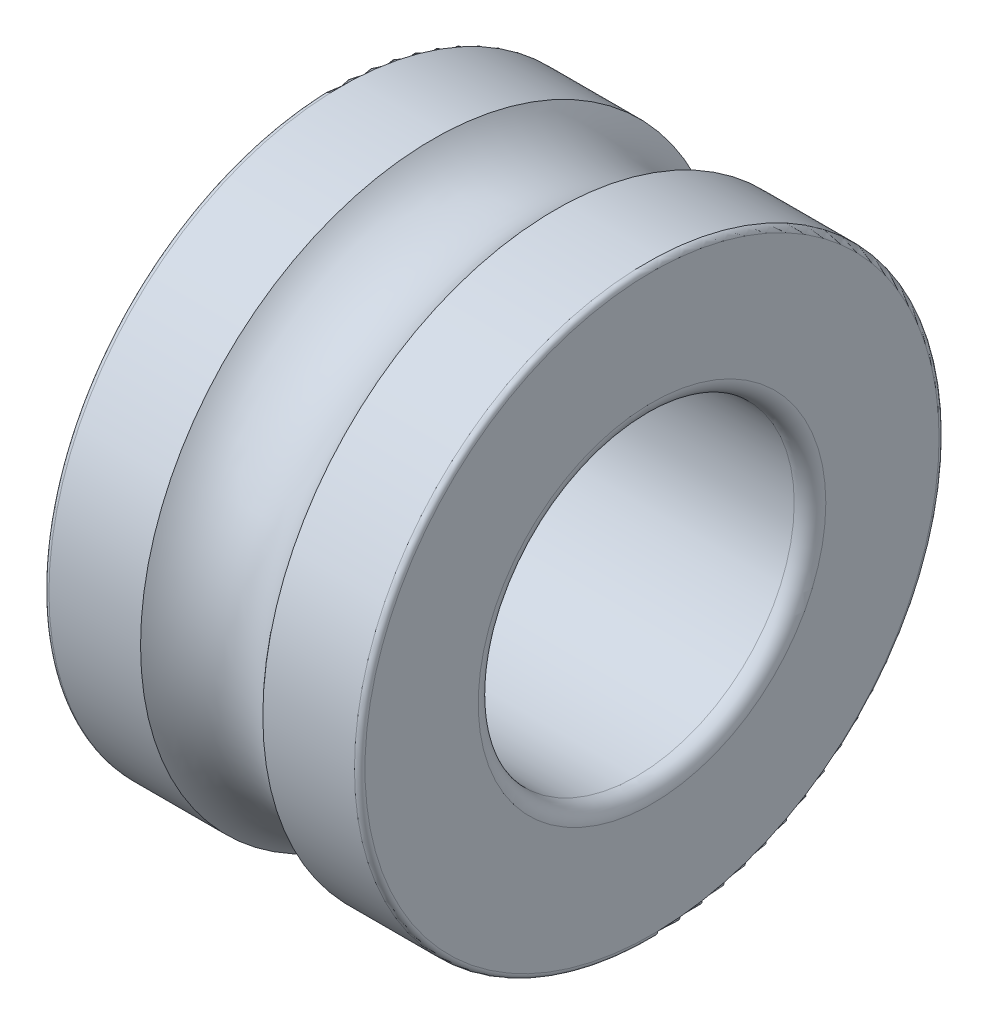
ISO-10303-21;
HEADER;
FILE_DESCRIPTION(('STEP AP214'),'2;1');
FILE_NAME('part.step','',(''),(''),'','','');
FILE_SCHEMA(('AUTOMOTIVE_DESIGN { 1 0 10303 214 1 1 1 1 }'));
ENDSEC;
DATA;
#1=APPLICATION_CONTEXT('core data for automotive mechanical design processes');
#2=APPLICATION_PROTOCOL_DEFINITION('international standard','automotive_design',2000,#1);
#3=PRODUCT_CONTEXT('',#1,'mechanical');
#4=PRODUCT('Part','Part','',(#3));
#5=PRODUCT_RELATED_PRODUCT_CATEGORY('part','',(#4));
#6=PRODUCT_DEFINITION_FORMATION('','',#4);
#7=PRODUCT_DEFINITION_CONTEXT('part definition',#1,'design');
#8=PRODUCT_DEFINITION('design','',#6,#7);
#9=PRODUCT_DEFINITION_SHAPE('','',#8);
#10=(LENGTH_UNIT() NAMED_UNIT(*) SI_UNIT(.MILLI.,.METRE.));
#11=(NAMED_UNIT(*) PLANE_ANGLE_UNIT() SI_UNIT($,.RADIAN.));
#12=(NAMED_UNIT(*) SI_UNIT($,.STERADIAN.) SOLID_ANGLE_UNIT());
#13=UNCERTAINTY_MEASURE_WITH_UNIT(LENGTH_MEASURE(1.E-05),#10,'distance_accuracy_value','');
#14=(GEOMETRIC_REPRESENTATION_CONTEXT(3) GLOBAL_UNCERTAINTY_ASSIGNED_CONTEXT((#13)) GLOBAL_UNIT_ASSIGNED_CONTEXT((#10,
#11,#12)) REPRESENTATION_CONTEXT('',''));
#15=CARTESIAN_POINT('',(0.,0.,0.));
#16=DIRECTION('',(0.,0.,1.));
#17=DIRECTION('',(1.,0.,0.));
#18=AXIS2_PLACEMENT_3D('',#15,#16,#17);
#19=CARTESIAN_POINT('',(0.299999999999939,0.,0.));
#20=DIRECTION('',(1.,0.,0.));
#21=DIRECTION('',(0.,0.,-1.));
#22=AXIS2_PLACEMENT_3D('',#19,#20,#21);
#23=TOROIDAL_SURFACE('',#22,3.29999999999994,0.299999999999939);
#24=CARTESIAN_POINT('',(0.3,0.,0.));
#25=DIRECTION('',(1.,0.,0.));
#26=DIRECTION('',(0.,0.,-1.));
#27=AXIS2_PLACEMENT_3D('',#24,#25,#26);
#28=CIRCLE('',#27,3.);
#29=CARTESIAN_POINT('',(0.3,0.,-3.));
#30=VERTEX_POINT('',#29);
#31=EDGE_CURVE('E10',#30,#30,#28,.T.);
#32=ORIENTED_EDGE('',*,*,#31,.T.);
#33=EDGE_LOOP('',(#32));
#34=FACE_BOUND('',#33,.T.);
#35=CARTESIAN_POINT('',(0.,0.,0.));
#36=DIRECTION('',(1.,0.,0.));
#37=DIRECTION('',(0.,0.,-1.));
#38=AXIS2_PLACEMENT_3D('',#35,#36,#37);
#39=CIRCLE('',#38,3.3);
#40=CARTESIAN_POINT('',(0.,0.,-3.3));
#41=VERTEX_POINT('',#40);
#42=EDGE_CURVE('E63',#41,#41,#39,.T.);
#43=ORIENTED_EDGE('',*,*,#42,.F.);
#44=EDGE_LOOP('',(#43));
#45=FACE_BOUND('',#44,.T.);
#46=ADVANCED_FACE('F29',(#34,#45),#23,.T.);
#47=CARTESIAN_POINT('',(5.7,0.,0.));
#48=DIRECTION('',(1.,0.,0.));
#49=DIRECTION('',(0.,0.,-1.));
#50=AXIS2_PLACEMENT_3D('',#47,#48,#49);
#51=CYLINDRICAL_SURFACE('',#50,3.);
#52=CARTESIAN_POINT('',(5.7,0.,0.));
#53=DIRECTION('',(1.,0.,0.));
#54=DIRECTION('',(0.,0.,-1.));
#55=AXIS2_PLACEMENT_3D('',#52,#53,#54);
#56=CIRCLE('',#55,3.);
#57=CARTESIAN_POINT('',(5.7,0.,-3.));
#58=VERTEX_POINT('',#57);
#59=EDGE_CURVE('E35',#58,#58,#56,.T.);
#60=ORIENTED_EDGE('',*,*,#59,.T.);
#61=EDGE_LOOP('',(#60));
#62=FACE_BOUND('',#61,.T.);
#63=ORIENTED_EDGE('',*,*,#31,.F.);
#64=EDGE_LOOP('',(#63));
#65=FACE_BOUND('',#64,.T.);
#66=ADVANCED_FACE('F71',(#62,#65),#51,.F.);
#67=CARTESIAN_POINT('',(5.70000000000012,0.,0.));
#68=DIRECTION('',(1.,0.,0.));
#69=DIRECTION('',(0.,0.,-1.));
#70=AXIS2_PLACEMENT_3D('',#67,#68,#69);
#71=TOROIDAL_SURFACE('',#70,3.29999999999988,0.299999999999877);
#72=CARTESIAN_POINT('',(6.,0.,0.));
#73=DIRECTION('',(1.,0.,0.));
#74=DIRECTION('',(0.,0.,-1.));
#75=AXIS2_PLACEMENT_3D('',#72,#73,#74);
#76=CIRCLE('',#75,3.3);
#77=CARTESIAN_POINT('',(6.,0.,-3.3));
#78=VERTEX_POINT('',#77);
#79=EDGE_CURVE('E39',#78,#78,#76,.T.);
#80=ORIENTED_EDGE('',*,*,#79,.T.);
#81=EDGE_LOOP('',(#80));
#82=FACE_BOUND('',#81,.T.);
#83=ORIENTED_EDGE('',*,*,#59,.F.);
#84=EDGE_LOOP('',(#83));
#85=FACE_BOUND('',#84,.T.);
#86=ADVANCED_FACE('F75',(#82,#85),#71,.T.);
#87=CARTESIAN_POINT('',(6.,3.3,0.));
#88=DIRECTION('',(1.,0.,0.));
#89=DIRECTION('',(0.,0.,-1.));
#90=AXIS2_PLACEMENT_3D('',#87,#88,#89);
#91=PLANE('',#90);
#92=CARTESIAN_POINT('',(6.,0.,0.));
#93=DIRECTION('',(1.,0.,0.));
#94=DIRECTION('',(0.,0.,-1.));
#95=AXIS2_PLACEMENT_3D('',#92,#93,#94);
#96=CIRCLE('',#95,5.45);
#97=CARTESIAN_POINT('',(6.,0.,-5.45));
#98=VERTEX_POINT('',#97);
#99=EDGE_CURVE('E43',#98,#98,#96,.T.);
#100=ORIENTED_EDGE('',*,*,#99,.T.);
#101=EDGE_LOOP('',(#100));
#102=FACE_BOUND('',#101,.T.);
#103=ORIENTED_EDGE('',*,*,#79,.F.);
#104=EDGE_LOOP('',(#103));
#105=FACE_BOUND('',#104,.T.);
#106=ADVANCED_FACE('F79',(#102,#105),#91,.T.);
#107=CARTESIAN_POINT('',(5.90000000000015,0.,0.));
#108=DIRECTION('',(1.,0.,0.));
#109=DIRECTION('',(0.,0.,-1.));
#110=AXIS2_PLACEMENT_3D('',#107,#108,#109);
#111=TOROIDAL_SURFACE('',#110,5.45000000000015,0.0999999999998454);
#112=CARTESIAN_POINT('',(5.9,0.,0.));
#113=DIRECTION('',(1.,0.,0.));
#114=DIRECTION('',(0.,0.,-1.));
#115=AXIS2_PLACEMENT_3D('',#112,#113,#114);
#116=CIRCLE('',#115,5.55);
#117=CARTESIAN_POINT('',(5.9,0.,-5.55));
#118=VERTEX_POINT('',#117);
#119=EDGE_CURVE('E48',#118,#118,#116,.T.);
#120=ORIENTED_EDGE('',*,*,#119,.T.);
#121=EDGE_LOOP('',(#120));
#122=FACE_BOUND('',#121,.T.);
#123=ORIENTED_EDGE('',*,*,#99,.F.);
#124=EDGE_LOOP('',(#123));
#125=FACE_BOUND('',#124,.T.);
#126=ADVANCED_FACE('F86',(#122,#125),#111,.T.);
#127=CARTESIAN_POINT('',(5.7,0.,0.));
#128=DIRECTION('',(1.,0.,0.));
#129=DIRECTION('',(0.,0.,-1.));
#130=AXIS2_PLACEMENT_3D('',#127,#128,#129);
#131=CYLINDRICAL_SURFACE('',#130,5.55);
#132=CARTESIAN_POINT('',(4.1608186766244,0.,0.));
#133=DIRECTION('',(1.,0.,0.));
#134=DIRECTION('',(0.,0.,-1.));
#135=AXIS2_PLACEMENT_3D('',#132,#133,#134);
#136=CIRCLE('',#135,5.55);
#137=CARTESIAN_POINT('',(4.1608186766244,0.,-5.55));
#138=VERTEX_POINT('',#137);
#139=EDGE_CURVE('E51',#138,#138,#136,.T.);
#140=ORIENTED_EDGE('',*,*,#139,.T.);
#141=EDGE_LOOP('',(#140));
#142=FACE_BOUND('',#141,.T.);
#143=ORIENTED_EDGE('',*,*,#119,.F.);
#144=EDGE_LOOP('',(#143));
#145=FACE_BOUND('',#144,.T.);
#146=ADVANCED_FACE('F90',(#142,#145),#131,.T.);
#147=CARTESIAN_POINT('',(3.,0.,0.));
#148=DIRECTION('',(1.,0.,0.));
#149=DIRECTION('',(0.,0.,-1.));
#150=AXIS2_PLACEMENT_3D('',#147,#148,#149);
#151=TOROIDAL_SURFACE('',#150,6.50000000000002,1.50000000000002);
#152=CARTESIAN_POINT('',(1.8391813233756,0.,0.));
#153=DIRECTION('',(1.,0.,0.));
#154=DIRECTION('',(0.,0.,-1.));
#155=AXIS2_PLACEMENT_3D('',#152,#153,#154);
#156=CIRCLE('',#155,5.55);
#157=CARTESIAN_POINT('',(1.8391813233756,0.,-5.55));
#158=VERTEX_POINT('',#157);
#159=EDGE_CURVE('E54',#158,#158,#156,.T.);
#160=ORIENTED_EDGE('',*,*,#159,.T.);
#161=EDGE_LOOP('',(#160));
#162=FACE_BOUND('',#161,.T.);
#163=ORIENTED_EDGE('',*,*,#139,.F.);
#164=EDGE_LOOP('',(#163));
#165=FACE_BOUND('',#164,.T.);
#166=ADVANCED_FACE('F94',(#162,#165),#151,.F.);
#167=CARTESIAN_POINT('',(5.7,0.,0.));
#168=DIRECTION('',(1.,0.,0.));
#169=DIRECTION('',(0.,0.,-1.));
#170=AXIS2_PLACEMENT_3D('',#167,#168,#169);
#171=CYLINDRICAL_SURFACE('',#170,5.55);
#172=CARTESIAN_POINT('',(0.1,0.,0.));
#173=DIRECTION('',(1.,0.,0.));
#174=DIRECTION('',(0.,0.,-1.));
#175=AXIS2_PLACEMENT_3D('',#172,#173,#174);
#176=CIRCLE('',#175,5.55);
#177=CARTESIAN_POINT('',(0.1,0.,-5.55));
#178=VERTEX_POINT('',#177);
#179=EDGE_CURVE('E57',#178,#178,#176,.T.);
#180=ORIENTED_EDGE('',*,*,#179,.T.);
#181=EDGE_LOOP('',(#180));
#182=FACE_BOUND('',#181,.T.);
#183=ORIENTED_EDGE('',*,*,#159,.F.);
#184=EDGE_LOOP('',(#183));
#185=FACE_BOUND('',#184,.T.);
#186=ADVANCED_FACE('F98',(#182,#185),#171,.T.);
#187=CARTESIAN_POINT('',(0.0999999999999234,0.,0.));
#188=DIRECTION('',(1.,0.,0.));
#189=DIRECTION('',(0.,0.,-1.));
#190=AXIS2_PLACEMENT_3D('',#187,#188,#189);
#191=TOROIDAL_SURFACE('',#190,5.45000000000008,0.0999999999999237);
#192=CARTESIAN_POINT('',(0.,0.,0.));
#193=DIRECTION('',(1.,0.,0.));
#194=DIRECTION('',(0.,0.,-1.));
#195=AXIS2_PLACEMENT_3D('',#192,#193,#194);
#196=CIRCLE('',#195,5.45);
#197=CARTESIAN_POINT('',(0.,0.,-5.45));
#198=VERTEX_POINT('',#197);
#199=EDGE_CURVE('E60',#198,#198,#196,.T.);
#200=ORIENTED_EDGE('',*,*,#199,.T.);
#201=EDGE_LOOP('',(#200));
#202=FACE_BOUND('',#201,.T.);
#203=ORIENTED_EDGE('',*,*,#179,.F.);
#204=EDGE_LOOP('',(#203));
#205=FACE_BOUND('',#204,.T.);
#206=ADVANCED_FACE('F102',(#202,#205),#191,.T.);
#207=CARTESIAN_POINT('',(0.,5.45,0.));
#208=DIRECTION('',(-1.,0.,0.));
#209=DIRECTION('',(0.,0.,1.));
#210=AXIS2_PLACEMENT_3D('',#207,#208,#209);
#211=PLANE('',#210);
#212=ORIENTED_EDGE('',*,*,#42,.T.);
#213=EDGE_LOOP('',(#212));
#214=FACE_BOUND('',#213,.T.);
#215=ORIENTED_EDGE('',*,*,#199,.F.);
#216=EDGE_LOOP('',(#215));
#217=FACE_BOUND('',#216,.T.);
#218=ADVANCED_FACE('F67',(#214,#217),#211,.T.);
#219=CLOSED_SHELL('',(#46,#66,#86,#106,#126,#146,#166,#186,#206,#218));
#220=MANIFOLD_SOLID_BREP('B2',#219);
#221=ADVANCED_BREP_SHAPE_REPRESENTATION('',(#18,#220),#14);
#222=SHAPE_DEFINITION_REPRESENTATION(#9,#221);
ENDSEC;
END-ISO-10303-21;
